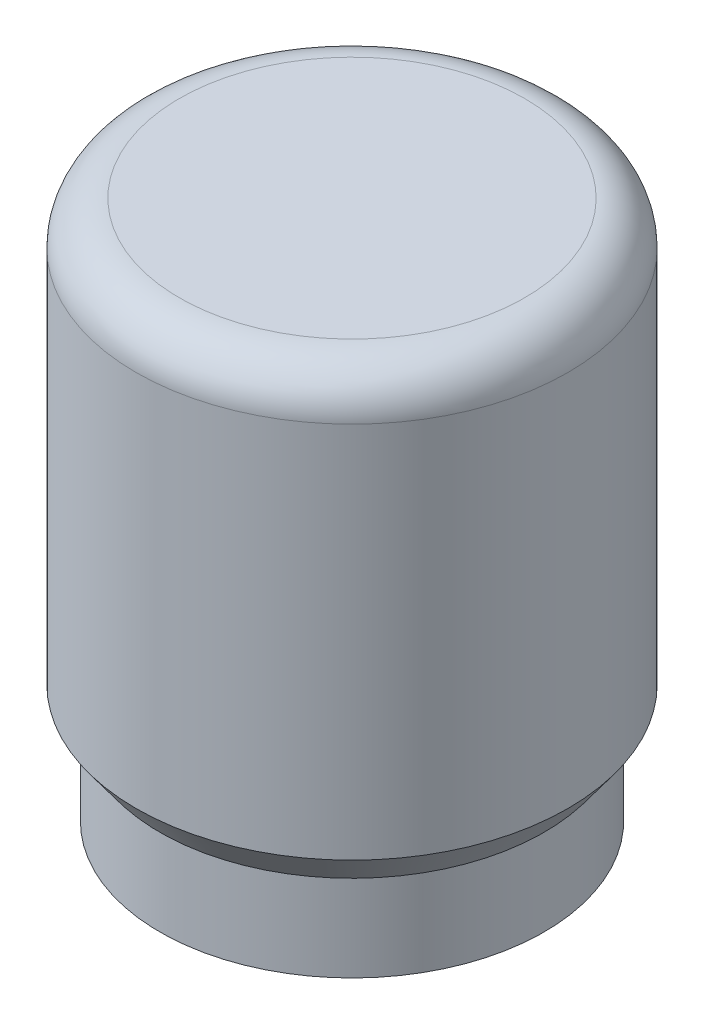
ISO-10303-21;
HEADER;
FILE_DESCRIPTION(('STEP AP214'),'2;1');
FILE_NAME('part.step','',(''),(''),'','','');
FILE_SCHEMA(('AUTOMOTIVE_DESIGN { 1 0 10303 214 1 1 1 1 }'));
ENDSEC;
DATA;
#1=APPLICATION_CONTEXT('core data for automotive mechanical design processes');
#2=APPLICATION_PROTOCOL_DEFINITION('international standard','automotive_design',2000,#1);
#3=PRODUCT_CONTEXT('',#1,'mechanical');
#4=PRODUCT('Part','Part','',(#3));
#5=PRODUCT_RELATED_PRODUCT_CATEGORY('part','',(#4));
#6=PRODUCT_DEFINITION_FORMATION('','',#4);
#7=PRODUCT_DEFINITION_CONTEXT('part definition',#1,'design');
#8=PRODUCT_DEFINITION('design','',#6,#7);
#9=PRODUCT_DEFINITION_SHAPE('','',#8);
#10=(LENGTH_UNIT() NAMED_UNIT(*) SI_UNIT(.MILLI.,.METRE.));
#11=(NAMED_UNIT(*) PLANE_ANGLE_UNIT() SI_UNIT($,.RADIAN.));
#12=(NAMED_UNIT(*) SI_UNIT($,.STERADIAN.) SOLID_ANGLE_UNIT());
#13=UNCERTAINTY_MEASURE_WITH_UNIT(LENGTH_MEASURE(1.E-05),#10,'distance_accuracy_value','');
#14=(GEOMETRIC_REPRESENTATION_CONTEXT(3) GLOBAL_UNCERTAINTY_ASSIGNED_CONTEXT((#13)) GLOBAL_UNIT_ASSIGNED_CONTEXT((#10,
#11,#12)) REPRESENTATION_CONTEXT('',''));
#15=CARTESIAN_POINT('',(0.,0.,0.));
#16=DIRECTION('',(0.,0.,1.));
#17=DIRECTION('',(1.,0.,0.));
#18=AXIS2_PLACEMENT_3D('',#15,#16,#17);
#19=CARTESIAN_POINT('',(0.,14.605,0.));
#20=DIRECTION('',(0.,-1.,0.));
#21=DIRECTION('',(0.,0.,-1.));
#22=AXIS2_PLACEMENT_3D('',#19,#20,#21);
#23=TOROIDAL_SURFACE('',#22,5.08,1.27);
#24=CARTESIAN_POINT('',(0.,15.875,0.));
#25=DIRECTION('',(0.,-1.,0.));
#26=DIRECTION('',(0.,0.,-1.));
#27=AXIS2_PLACEMENT_3D('',#24,#25,#26);
#28=CIRCLE('',#27,5.08);
#29=CARTESIAN_POINT('',(0.,15.875,-5.08));
#30=VERTEX_POINT('',#29);
#31=EDGE_CURVE('E74',#30,#30,#28,.T.);
#32=ORIENTED_EDGE('',*,*,#31,.T.);
#33=EDGE_LOOP('',(#32));
#34=FACE_BOUND('',#33,.T.);
#35=CARTESIAN_POINT('',(0.,14.605,0.));
#36=DIRECTION('',(0.,-1.,0.));
#37=DIRECTION('',(0.,0.,-1.));
#38=AXIS2_PLACEMENT_3D('',#35,#36,#37);
#39=CIRCLE('',#38,6.35);
#40=CARTESIAN_POINT('',(0.,14.605,-6.35));
#41=VERTEX_POINT('',#40);
#42=EDGE_CURVE('E11',#41,#41,#39,.T.);
#43=ORIENTED_EDGE('',*,*,#42,.F.);
#44=EDGE_LOOP('',(#43));
#45=FACE_BOUND('',#44,.T.);
#46=ADVANCED_FACE('F33',(#34,#45),#23,.T.);
#47=CARTESIAN_POINT('',(0.,0.,0.));
#48=DIRECTION('',(0.,-1.,0.));
#49=DIRECTION('',(0.,0.,-1.));
#50=AXIS2_PLACEMENT_3D('',#47,#48,#49);
#51=CYLINDRICAL_SURFACE('',#50,6.35);
#52=CARTESIAN_POINT('',(0.,8.9662,-6.35));
#53=CARTESIAN_POINT('',(0.0951449863036409,8.96619789147214,-6.34999863875941));
#54=CARTESIAN_POINT('',(0.190312288851531,8.95831190836092,-6.34784064346853));
#55=CARTESIAN_POINT('',(0.377900784745492,8.92703504636082,-6.33944172576789));
#56=CARTESIAN_POINT('',(0.470320714382607,8.90363714432022,-6.33319895395791));
#57=CARTESIAN_POINT('',(0.649679940351944,8.84215689864135,-6.31731876401478));
#58=CARTESIAN_POINT('',(0.736626286687476,8.80409391334608,-6.30768582245074));
#59=CARTESIAN_POINT('',(0.902901574741107,8.71443692060387,-6.28604072665375));
#60=CARTESIAN_POINT('',(0.982229927307515,8.66284186777881,-6.27402838862543));
#61=CARTESIAN_POINT('',(1.13292446066586,8.54627611010616,-6.24859613189591));
#62=CARTESIAN_POINT('',(1.20408142778442,8.48104034875201,-6.23515139682222));
#63=CARTESIAN_POINT('',(1.33459195857133,8.33961131077172,-6.20852721689338));
#64=CARTESIAN_POINT('',(1.39394393677014,8.26341656466341,-6.19534780788622));
#65=CARTESIAN_POINT('',(1.50019197608792,8.10054726539216,-6.17049137148356));
#66=CARTESIAN_POINT('',(1.54684512722838,8.01370904212055,-6.1588455857585));
#67=CARTESIAN_POINT('',(1.62480576859993,7.8330531566705,-6.1387407874426));
#68=CARTESIAN_POINT('',(1.65611621594531,7.73923684344963,-6.13028116083224));
#69=CARTESIAN_POINT('',(1.70177180214679,7.54961011264782,-6.11776309569238));
#70=CARTESIAN_POINT('',(1.71649726990973,7.45389792706884,-6.11360617617922));
#71=CARTESIAN_POINT('',(1.72975094731642,7.26127835068999,-6.10987013883377));
#72=CARTESIAN_POINT('',(1.72828231634452,7.16437119670718,-6.11029012807023));
#73=CARTESIAN_POINT('',(1.70949093267711,6.97509947123521,-6.11557244215812));
#74=CARTESIAN_POINT('',(1.6926307931423,6.88268477354555,-6.12030513530989));
#75=CARTESIAN_POINT('',(1.64427691366298,6.70204801188243,-6.13347170999125));
#76=CARTESIAN_POINT('',(1.61278196212681,6.6138262957056,-6.1419058979582));
#77=CARTESIAN_POINT('',(1.53568116284808,6.44288536879236,-6.16163749262478));
#78=CARTESIAN_POINT('',(1.48991501354338,6.36024234000684,-6.1729671478322));
#79=CARTESIAN_POINT('',(1.38568270537137,6.20364765257256,-6.19719605878187));
#80=CARTESIAN_POINT('',(1.32721395584747,6.12969777161298,-6.21009563446823));
#81=CARTESIAN_POINT('',(1.19688110939867,5.9899482409435,-6.23654842675368));
#82=CARTESIAN_POINT('',(1.12462920064179,5.92451112904993,-6.25010895618575));
#83=CARTESIAN_POINT('',(0.970010724753629,5.80660646666903,-6.27596319686257));
#84=CARTESIAN_POINT('',(0.887643726686708,5.75413946903778,-6.28825685409337));
#85=CARTESIAN_POINT('',(0.714556958944036,5.6634957646648,-6.31027294241733));
#86=CARTESIAN_POINT('',(0.623799990969472,5.62538691286079,-6.31998310231079));
#87=CARTESIAN_POINT('',(0.436842597805193,5.56507348110458,-6.33564952931861));
#88=CARTESIAN_POINT('',(0.340643417178253,5.54286528061886,-6.34160665095209));
#89=CARTESIAN_POINT('',(0.148624454884181,5.51555800182054,-6.34896565310046));
#90=CARTESIAN_POINT('',(0.0528796523447617,5.50996627599482,-6.35049865947629));
#91=CARTESIAN_POINT('',(-0.138180466350691,5.51468706727376,-6.34921487161198));
#92=CARTESIAN_POINT('',(-0.233495827720302,5.52499786889324,-6.34639854655591));
#93=CARTESIAN_POINT('',(-0.4192176472349,5.56082770991179,-6.33681743547874));
#94=CARTESIAN_POINT('',(-0.509681554300033,5.58606996741095,-6.33012455441942));
#95=CARTESIAN_POINT('',(-0.685080515875142,5.65072301107799,-6.3135514774359));
#96=CARTESIAN_POINT('',(-0.770014958031545,5.6901353633533,-6.30367092921669));
#97=CARTESIAN_POINT('',(-0.933842871298505,5.78291015753946,-6.28151367373741));
#98=CARTESIAN_POINT('',(-1.01257992293401,5.83653796387576,-6.26919265156916));
#99=CARTESIAN_POINT('',(-1.16010959845038,5.95588954499191,-6.24357763517254));
#100=CARTESIAN_POINT('',(-1.22890017081352,6.02161580881088,-6.23028344107123));
#101=CARTESIAN_POINT('',(-1.35667489085896,6.16560078405838,-6.20373464008594));
#102=CARTESIAN_POINT('',(-1.41531088896525,6.24417137654907,-6.19049271062574));
#103=CARTESIAN_POINT('',(-1.5185758631089,6.41031885211516,-6.16597557643662));
#104=CARTESIAN_POINT('',(-1.5632054027687,6.49789537260204,-6.15470029257764));
#105=CARTESIAN_POINT('',(-1.6368559751369,6.6791484834366,-6.13552375399684));
#106=CARTESIAN_POINT('',(-1.66596580431958,6.77278685645487,-6.12760335896582));
#107=CARTESIAN_POINT('',(-1.70795018568577,6.9638830851753,-6.11603543572629));
#108=CARTESIAN_POINT('',(-1.72082909286853,7.0613399090906,-6.11238676136987));
#109=CARTESIAN_POINT('',(-1.72972820607105,7.25373465762908,-6.10987385307678));
#110=CARTESIAN_POINT('',(-1.72630910449696,7.34864494957619,-6.11085048923279));
#111=CARTESIAN_POINT('',(-1.70401564164396,7.53648094748427,-6.11710404836426));
#112=CARTESIAN_POINT('',(-1.68514170902971,7.62940670841607,-6.12238085206763));
#113=CARTESIAN_POINT('',(-1.63280539478538,7.80989810539161,-6.13654353855073));
#114=CARTESIAN_POINT('',(-1.59946635118619,7.89750207273098,-6.14539886587388));
#115=CARTESIAN_POINT('',(-1.51924173886316,8.06594035637948,-6.16572049242441));
#116=CARTESIAN_POINT('',(-1.47235396775738,8.14677356932667,-6.17718721607701));
#117=CARTESIAN_POINT('',(-1.36468279754848,8.30204093302555,-6.20187674823452));
#118=CARTESIAN_POINT('',(-1.30351895887018,8.37620447054231,-6.21514247340964));
#119=CARTESIAN_POINT('',(-1.16974944785565,8.5133972273559,-6.24170076170646));
#120=CARTESIAN_POINT('',(-1.09714097225845,8.57642371068786,-6.25499333061375));
#121=CARTESIAN_POINT('',(-0.940569840441394,8.69095231575586,-6.28046587068278));
#122=CARTESIAN_POINT('',(-0.856388240274029,8.74216281841212,-6.29261402973329));
#123=CARTESIAN_POINT('',(-0.680282177868769,8.82962505398807,-6.31407641863104));
#124=CARTESIAN_POINT('',(-0.588362527640945,8.8658860019416,-6.32339239332814));
#125=CARTESIAN_POINT('',(-0.414040485051695,8.91791147235791,-6.33699456382282));
#126=CARTESIAN_POINT('',(-0.332360724920962,8.93597659493757,-6.34183536085971));
#127=CARTESIAN_POINT('',(-0.167126247178072,8.96012113992317,-6.34833850577101));
#128=CARTESIAN_POINT('',(-0.0835717322995386,8.96620185205056,-6.3500011956619));
#129=CARTESIAN_POINT('',(0.,8.9662,-6.35));
#130=B_SPLINE_CURVE_WITH_KNOTS('',3,(#52,#53,#54,#55,#56,#57,#58,#59,#60,#61,#62,#63,#64,#65,
#66,#67,#68,#69,#70,#71,#72,#73,#74,#75,#76,#77,#78,#79,#80,#81,#82,#83,#84,#85,#86,#87,#88,#89,
#90,#91,#92,#93,#94,#95,#96,#97,#98,#99,#100,#101,#102,#103,#104,#105,#106,#107,#108,#109,#110,
#111,#112,#113,#114,#115,#116,#117,#118,#119,#120,#121,#122,#123,#124,#125,#126,#127,#128,#129),
.UNSPECIFIED.,.T.,.F.,(4,2,2,2,2,2,2,2,2,2,2,2,2,2,2,2,2,2,2,2,2,2,2,2,2,2,2,2,2,2,2,2,2,2,2,2,
2,2,4),(0.,0.285128405017792,0.57038599256176,0.855268314675117,1.14017265097861,
1.43123640676031,1.72233922751515,2.01867139312996,2.31494642193913,2.60427934323216,
2.89355581817747,3.17441408333316,3.45529560441984,3.73945326293843,4.02366892903956,
4.31754671771736,4.61143703088901,4.90669931535446,5.20189434803006,5.48824548103982,
5.7745657260811,6.05573785032932,6.33694105984503,6.62381671145078,6.91075144863872,
7.20612995590427,7.50149657556014,7.7951546002332,8.08873381527749,8.37228753102227,
8.65583338221403,8.93700765801566,9.21822766518484,9.50803100601369,9.79790544219255,
10.094310404606,10.3905323862964,10.6410052744421,10.8914512060763),.UNSPECIFIED.);
#131=CARTESIAN_POINT('',(0.,8.9662,-6.35));
#132=VERTEX_POINT('',#131);
#133=EDGE_CURVE('E101',#132,#132,#130,.T.);
#134=ORIENTED_EDGE('',*,*,#133,.F.);
#135=EDGE_LOOP('',(#134));
#136=FACE_BOUND('',#135,.T.);
#137=ORIENTED_EDGE('',*,*,#42,.T.);
#138=EDGE_LOOP('',(#137));
#139=FACE_BOUND('',#138,.T.);
#140=CARTESIAN_POINT('',(0.,3.49584210526316,0.));
#141=DIRECTION('',(0.,-1.,0.));
#142=DIRECTION('',(0.,0.,-1.));
#143=AXIS2_PLACEMENT_3D('',#140,#141,#142);
#144=CIRCLE('',#143,6.35);
#145=CARTESIAN_POINT('',(0.,3.49584210526316,-6.35));
#146=VERTEX_POINT('',#145);
#147=EDGE_CURVE('E44',#146,#146,#144,.T.);
#148=ORIENTED_EDGE('',*,*,#147,.F.);
#149=EDGE_LOOP('',(#148));
#150=FACE_BOUND('',#149,.T.);
#151=ADVANCED_FACE('F64',(#136,#139,#150),#51,.T.);
#152=CARTESIAN_POINT('',(0.,2.54,0.));
#153=DIRECTION('',(0.,1.,0.));
#154=DIRECTION('',(0.,0.,1.));
#155=AXIS2_PLACEMENT_3D('',#152,#153,#154);
#156=CONICAL_SURFACE('',#155,5.6515,0.63107938747133);
#157=ORIENTED_EDGE('',*,*,#147,.T.);
#158=EDGE_LOOP('',(#157));
#159=FACE_BOUND('',#158,.T.);
#160=CARTESIAN_POINT('',(0.,2.54,0.));
#161=DIRECTION('',(0.,-1.,0.));
#162=DIRECTION('',(0.,0.,-1.));
#163=AXIS2_PLACEMENT_3D('',#160,#161,#162);
#164=CIRCLE('',#163,5.6515);
#165=CARTESIAN_POINT('',(0.,2.54,-5.6515));
#166=VERTEX_POINT('',#165);
#167=EDGE_CURVE('E81',#166,#166,#164,.T.);
#168=ORIENTED_EDGE('',*,*,#167,.F.);
#169=EDGE_LOOP('',(#168));
#170=FACE_BOUND('',#169,.T.);
#171=ADVANCED_FACE('F69',(#159,#170),#156,.T.);
#172=CARTESIAN_POINT('',(0.,0.,0.));
#173=DIRECTION('',(0.,-1.,0.));
#174=DIRECTION('',(0.,0.,-1.));
#175=AXIS2_PLACEMENT_3D('',#172,#173,#174);
#176=CYLINDRICAL_SURFACE('',#175,5.6515);
#177=ORIENTED_EDGE('',*,*,#167,.T.);
#178=EDGE_LOOP('',(#177));
#179=FACE_BOUND('',#178,.T.);
#180=CARTESIAN_POINT('',(0.,0.,0.));
#181=DIRECTION('',(0.,-1.,0.));
#182=DIRECTION('',(0.,0.,-1.));
#183=AXIS2_PLACEMENT_3D('',#180,#181,#182);
#184=CIRCLE('',#183,5.6515);
#185=CARTESIAN_POINT('',(0.,0.,-5.6515));
#186=VERTEX_POINT('',#185);
#187=EDGE_CURVE('E84',#186,#186,#184,.T.);
#188=ORIENTED_EDGE('',*,*,#187,.F.);
#189=EDGE_LOOP('',(#188));
#190=FACE_BOUND('',#189,.T.);
#191=ADVANCED_FACE('F136',(#179,#190),#176,.T.);
#192=CARTESIAN_POINT('',(5.6515,0.,0.));
#193=DIRECTION('',(0.,-1.,0.));
#194=DIRECTION('',(0.,0.,-1.));
#195=AXIS2_PLACEMENT_3D('',#192,#193,#194);
#196=PLANE('',#195);
#197=ORIENTED_EDGE('',*,*,#187,.T.);
#198=EDGE_LOOP('',(#197));
#199=FACE_BOUND('',#198,.T.);
#200=CARTESIAN_POINT('',(0.,0.,0.));
#201=DIRECTION('',(0.,-1.,0.));
#202=DIRECTION('',(0.,0.,-1.));
#203=AXIS2_PLACEMENT_3D('',#200,#201,#202);
#204=CIRCLE('',#203,4.7625);
#205=CARTESIAN_POINT('',(0.,0.,-4.7625));
#206=VERTEX_POINT('',#205);
#207=EDGE_CURVE('E89',#206,#206,#204,.T.);
#208=ORIENTED_EDGE('',*,*,#207,.F.);
#209=EDGE_LOOP('',(#208));
#210=FACE_BOUND('',#209,.T.);
#211=ADVANCED_FACE('F129',(#199,#210),#196,.T.);
#212=CARTESIAN_POINT('',(0.,0.,0.));
#213=DIRECTION('',(0.,-1.,0.));
#214=DIRECTION('',(0.,0.,-1.));
#215=AXIS2_PLACEMENT_3D('',#212,#213,#214);
#216=CYLINDRICAL_SURFACE('',#215,4.7625);
#217=ORIENTED_EDGE('',*,*,#207,.T.);
#218=EDGE_LOOP('',(#217));
#219=FACE_BOUND('',#218,.T.);
#220=CARTESIAN_POINT('',(0.,3.9878,0.));
#221=DIRECTION('',(0.,-1.,0.));
#222=DIRECTION('',(0.,0.,-1.));
#223=AXIS2_PLACEMENT_3D('',#220,#221,#222);
#224=CIRCLE('',#223,4.7625);
#225=CARTESIAN_POINT('',(0.,3.9878,-4.7625));
#226=VERTEX_POINT('',#225);
#227=EDGE_CURVE('E92',#226,#226,#224,.T.);
#228=ORIENTED_EDGE('',*,*,#227,.F.);
#229=EDGE_LOOP('',(#228));
#230=FACE_BOUND('',#229,.T.);
#231=ADVANCED_FACE('F123',(#219,#230),#216,.F.);
#232=CARTESIAN_POINT('',(4.7625,3.9878,0.));
#233=DIRECTION('',(0.,-1.,0.));
#234=DIRECTION('',(0.,0.,-1.));
#235=AXIS2_PLACEMENT_3D('',#232,#233,#234);
#236=PLANE('',#235);
#237=ORIENTED_EDGE('',*,*,#227,.T.);
#238=EDGE_LOOP('',(#237));
#239=FACE_BOUND('',#238,.T.);
#240=CARTESIAN_POINT('',(0.,3.9878,0.));
#241=DIRECTION('',(0.,-1.,0.));
#242=DIRECTION('',(0.,0.,-1.));
#243=AXIS2_PLACEMENT_3D('',#240,#241,#242);
#244=CIRCLE('',#243,3.);
#245=CARTESIAN_POINT('',(0.,3.9878,-3.));
#246=VERTEX_POINT('',#245);
#247=EDGE_CURVE('E95',#246,#246,#244,.T.);
#248=ORIENTED_EDGE('',*,*,#247,.F.);
#249=EDGE_LOOP('',(#248));
#250=FACE_BOUND('',#249,.T.);
#251=ADVANCED_FACE('F60',(#239,#250),#236,.T.);
#252=CARTESIAN_POINT('',(0.,0.,0.));
#253=DIRECTION('',(0.,-1.,0.));
#254=DIRECTION('',(0.,0.,-1.));
#255=AXIS2_PLACEMENT_3D('',#252,#253,#254);
#256=CYLINDRICAL_SURFACE('',#255,3.);
#257=CARTESIAN_POINT('',(0.,8.9662,-3.));
#258=CARTESIAN_POINT('',(-0.088957178395058,8.96619525177285,-2.99999572186425));
#259=CARTESIAN_POINT('',(-0.178059757961187,8.9592803553216,-2.99599981494156));
#260=CARTESIAN_POINT('',(-0.353604065731126,8.9319604936281,-2.98039824386921));
#261=CARTESIAN_POINT('',(-0.440038633113218,8.91152205529975,-2.96877369811598));
#262=CARTESIAN_POINT('',(-0.607345936496613,8.85826546856337,-2.93910119187331));
#263=CARTESIAN_POINT('',(-0.688242999982242,8.82550621107138,-2.92108381061783));
#264=CARTESIAN_POINT('',(-0.843171090611766,8.74888689038463,-2.88018940121096));
#265=CARTESIAN_POINT('',(-0.91720384577218,8.70502963141754,-2.85731360091248));
#266=CARTESIAN_POINT('',(-1.06240583874449,8.60388255981404,-2.806710988612));
#267=CARTESIAN_POINT('',(-1.13297302814551,8.54584666287256,-2.77875212504775));
#268=CARTESIAN_POINT('',(-1.26395818909509,8.41964205559735,-2.72167701928767));
#269=CARTESIAN_POINT('',(-1.32436395829543,8.35146134532895,-2.69255943677675));
#270=CARTESIAN_POINT('',(-1.44007493920136,8.19797757353581,-2.63265634167467));
#271=CARTESIAN_POINT('',(-1.49407478701677,8.11161453381473,-2.60204313717596));
#272=CARTESIAN_POINT('',(-1.58656363887581,7.92925025783439,-2.54671077371979));
#273=CARTESIAN_POINT('',(-1.62507638569877,7.83326405898344,-2.52198261652682));
#274=CARTESIAN_POINT('',(-1.67794366597839,7.65640793679905,-2.48702133910358));
#275=CARTESIAN_POINT('',(-1.69577919427152,7.57697615068264,-2.47478111587059));
#276=CARTESIAN_POINT('',(-1.720075135497,7.41562912739067,-2.45796043182049));
#277=CARTESIAN_POINT('',(-1.72654802110821,7.33371671381698,-2.45337157244254));
#278=CARTESIAN_POINT('',(-1.72775888653904,7.1696439857797,-2.45251915085678));
#279=CARTESIAN_POINT('',(-1.7224798954531,7.08748348413406,-2.45626762860509));
#280=CARTESIAN_POINT('',(-1.70046948261898,6.92543918071039,-2.47155314164618));
#281=CARTESIAN_POINT('',(-1.68373006753162,6.84555700853961,-2.48309561296385));
#282=CARTESIAN_POINT('',(-1.63974849495735,6.69043996797567,-2.51235135009782));
#283=CARTESIAN_POINT('',(-1.61256016779111,6.61518353679331,-2.53003294424632));
#284=CARTESIAN_POINT('',(-1.54863283681664,6.47007163604411,-2.56965908483862));
#285=CARTESIAN_POINT('',(-1.51189020049287,6.40021823382452,-2.59160525185466));
#286=CARTESIAN_POINT('',(-1.42300005389724,6.25584300156301,-2.64160371816294));
#287=CARTESIAN_POINT('',(-1.36931954291139,6.18240682656482,-2.67006876458206));
#288=CARTESIAN_POINT('',(-1.25120354730753,6.04487370902029,-2.72741757184295));
#289=CARTESIAN_POINT('',(-1.18675871654988,5.9807849737794,-2.75630167645772));
#290=CARTESIAN_POINT('',(-1.03988156000557,5.85618020419751,-2.81524641087587));
#291=CARTESIAN_POINT('',(-0.956225503496786,5.79696840409932,-2.84504661661512));
#292=CARTESIAN_POINT('',(-0.778316022760589,5.69368409715477,-2.89876446308849));
#293=CARTESIAN_POINT('',(-0.684069214742307,5.64960220744279,-2.92268574703251));
#294=CARTESIAN_POINT('',(-0.494263674693495,5.58117393764256,-2.96047489562646));
#295=CARTESIAN_POINT('',(-0.399236376421066,5.55568315673514,-2.97491885903034));
#296=CARTESIAN_POINT('',(-0.205330475834635,5.52123196759914,-2.99454501892198));
#297=CARTESIAN_POINT('',(-0.106455890846233,5.5122547651237,-2.99973662485463));
#298=CARTESIAN_POINT('',(0.0791195795043313,5.51143245690457,-3.00021296702448));
#299=CARTESIAN_POINT('',(0.165816538188768,5.51760928977649,-2.99664153802955));
#300=CARTESIAN_POINT('',(0.336711468814566,5.54273874398873,-2.98227689280544));
#301=CARTESIAN_POINT('',(0.420909409740651,5.561691523822,-2.97148358698474));
#302=CARTESIAN_POINT('',(0.583580840000068,5.61117919141931,-2.9438355165247));
#303=CARTESIAN_POINT('',(0.662111589963159,5.64157010633352,-2.9270562294967));
#304=CARTESIAN_POINT('',(0.813002085415193,5.71282316300994,-2.8887876171751));
#305=CARTESIAN_POINT('',(0.885360383407257,5.75368775199687,-2.86729719127106));
#306=CARTESIAN_POINT('',(1.02997875767283,5.84952015256256,-2.81878518680845));
#307=CARTESIAN_POINT('',(1.10144266445733,5.90551393529825,-2.79142057704255));
#308=CARTESIAN_POINT('',(1.23451495882029,6.02765181330409,-2.73517892125234));
#309=CARTESIAN_POINT('',(1.29611181947061,6.0938076059557,-2.70630015786033));
#310=CARTESIAN_POINT('',(1.41489444076671,6.24329729872007,-2.64631561491998));
#311=CARTESIAN_POINT('',(1.47076877553742,6.32773064191085,-2.61533316674441));
#312=CARTESIAN_POINT('',(1.56742269333947,6.50641047272818,-2.55858146031653));
#313=CARTESIAN_POINT('',(1.60822186416989,6.60064402094431,-2.53280545700427));
#314=CARTESIAN_POINT('',(1.66588886334967,6.77573567830077,-2.49514287255722));
#315=CARTESIAN_POINT('',(1.68601113464146,6.85513403553,-2.48146369798536));
#316=CARTESIAN_POINT('',(1.71481814265424,7.01686297349648,-2.46164870238754));
#317=CARTESIAN_POINT('',(1.72351633033901,7.09918998839619,-2.45550401066541));
#318=CARTESIAN_POINT('',(1.72899615097863,7.26463051494138,-2.45164970391752));
#319=CARTESIAN_POINT('',(1.72575102848437,7.34774537590942,-2.45395902754771));
#320=CARTESIAN_POINT('',(1.70748527065169,7.51205022945451,-2.46670032916554));
#321=CARTESIAN_POINT('',(1.69245725492443,7.5932389827369,-2.47713739805838));
#322=CARTESIAN_POINT('',(1.65186956199779,7.74983917314406,-2.50437631683445));
#323=CARTESIAN_POINT('',(1.62654360271558,7.82533736262805,-2.52103629183799));
#324=CARTESIAN_POINT('',(1.5663232651711,7.97117715354389,-2.55888508226331));
#325=CARTESIAN_POINT('',(1.53142540754798,8.0415168680771,-2.5800755438867));
#326=CARTESIAN_POINT('',(1.44683240588001,8.18662742625477,-2.62857376888971));
#327=CARTESIAN_POINT('',(1.395684207535,8.26040430901485,-2.65632084511263));
#328=CARTESIAN_POINT('',(1.28277825168906,8.39904434447575,-2.71264915569304));
#329=CARTESIAN_POINT('',(1.22101104293199,8.46389946315348,-2.74123111414772));
#330=CARTESIAN_POINT('',(1.07907460038926,8.59142872800046,-2.80040159876259));
#331=CARTESIAN_POINT('',(0.997556458710613,8.65271911925823,-2.83076675327214));
#332=CARTESIAN_POINT('',(0.823643286823735,8.76060213703301,-2.88615825234293));
#333=CARTESIAN_POINT('',(0.731254424536104,8.80720304349524,-2.9111876019246));
#334=CARTESIAN_POINT('',(0.555280994876818,8.87673580316312,-2.94928415491367));
#335=CARTESIAN_POINT('',(0.473061959487046,8.90240584210788,-2.96368827878003));
#336=CARTESIAN_POINT('',(0.304968866333643,8.94123638442083,-2.98565355667014));
#337=CARTESIAN_POINT('',(0.219105870370107,8.95443226298199,-2.99323405871273));
#338=CARTESIAN_POINT('',(0.110639187532516,8.96279587147931,-2.99804144590568));
#339=CARTESIAN_POINT('',(0.0885406697673401,8.9640711030598,-2.99877473789585));
#340=CARTESIAN_POINT('',(0.0442977773597713,8.96577381046081,-2.99975457744592));
#341=CARTESIAN_POINT('',(0.0221533974343778,8.96620118247189,-3.00000106540297));
#342=CARTESIAN_POINT('',(0.,8.9662,-3.));
#343=B_SPLINE_CURVE_WITH_KNOTS('',3,(#257,#258,#259,#260,#261,#262,#263,#264,#265,#266,#267,
#268,#269,#270,#271,#272,#273,#274,#275,#276,#277,#278,#279,#280,#281,#282,#283,#284,#285,#286,
#287,#288,#289,#290,#291,#292,#293,#294,#295,#296,#297,#298,#299,#300,#301,#302,#303,#304,#305,
#306,#307,#308,#309,#310,#311,#312,#313,#314,#315,#316,#317,#318,#319,#320,#321,#322,#323,#324,
#325,#326,#327,#328,#329,#330,#331,#332,#333,#334,#335,#336,#337,#338,#339,#340,#341,#342),
.UNSPECIFIED.,.T.,.F.,(4,2,2,2,2,2,2,2,2,2,2,2,2,2,2,2,2,2,2,2,2,2,2,2,2,2,2,2,2,2,2,2,2,2,2,2,
2,2,2,2,2,2,4),(0.,0.26677813994696,0.534219084116476,0.800397635795866,1.06650899688925,
1.35201710108215,1.63786564755063,1.95536521341845,2.27237615799585,2.51828602780104,
2.76392579518604,3.00992052146354,3.25608699750878,3.50100192366422,3.74601010212638,
4.03082814444813,4.31589477839881,4.63445087880184,4.9528090670813,5.24937455495953,
5.54563826975523,5.80532990271289,6.06502475735348,6.32155456466734,6.57814436614483,
6.86147580211717,7.14513585630113,7.46125667158619,7.77696528113654,8.02503529369942,
8.27281296062349,8.52114603754375,8.76963478592958,9.01277345717991,9.25600062611897,
9.53679997896462,9.81785055837522,10.1354993130807,10.4529686988713,10.7138567914664,
10.9740027980122,11.0404315988436,11.1068685325197),.UNSPECIFIED.);
#344=CARTESIAN_POINT('',(0.,8.9662,-3.));
#345=VERTEX_POINT('',#344);
#346=EDGE_CURVE('E36',#345,#345,#343,.T.);
#347=ORIENTED_EDGE('',*,*,#346,.F.);
#348=EDGE_LOOP('',(#347));
#349=FACE_BOUND('',#348,.T.);
#350=ORIENTED_EDGE('',*,*,#247,.T.);
#351=EDGE_LOOP('',(#350));
#352=FACE_BOUND('',#351,.T.);
#353=CARTESIAN_POINT('',(0.,12.954,0.));
#354=DIRECTION('',(0.,-1.,0.));
#355=DIRECTION('',(0.,0.,-1.));
#356=AXIS2_PLACEMENT_3D('',#353,#354,#355);
#357=CIRCLE('',#356,3.);
#358=CARTESIAN_POINT('',(0.,12.954,-3.));
#359=VERTEX_POINT('',#358);
#360=EDGE_CURVE('E98',#359,#359,#357,.T.);
#361=ORIENTED_EDGE('',*,*,#360,.F.);
#362=EDGE_LOOP('',(#361));
#363=FACE_BOUND('',#362,.T.);
#364=ADVANCED_FACE('F50',(#349,#352,#363),#256,.F.);
#365=CARTESIAN_POINT('',(0.,14.6860508075689,0.));
#366=DIRECTION('',(0.,-1.,0.));
#367=DIRECTION('',(0.,0.,-1.));
#368=AXIS2_PLACEMENT_3D('',#365,#366,#367);
#369=CONICAL_SURFACE('',#368,0.,1.0471975511966);
#370=ORIENTED_EDGE('',*,*,#360,.T.);
#371=EDGE_LOOP('',(#370));
#372=FACE_BOUND('',#371,.T.);
#373=CARTESIAN_POINT('',(0.,14.6860508075689,0.));
#374=VERTEX_POINT('',#373);
#375=VERTEX_LOOP('',#374);
#376=FACE_BOUND('',#375,.T.);
#377=ADVANCED_FACE('F47',(#372,#376),#369,.F.);
#378=CARTESIAN_POINT('',(0.,15.875,0.));
#379=DIRECTION('',(0.,1.,0.));
#380=DIRECTION('',(0.,0.,1.));
#381=AXIS2_PLACEMENT_3D('',#378,#379,#380);
#382=PLANE('',#381);
#383=ORIENTED_EDGE('',*,*,#31,.F.);
#384=EDGE_LOOP('',(#383));
#385=FACE_BOUND('',#384,.T.);
#386=ADVANCED_FACE('F49',(#385),#382,.T.);
#387=CARTESIAN_POINT('',(0.,7.239,-6.35));
#388=DIRECTION('',(0.,0.,1.));
#389=DIRECTION('',(1.,0.,0.));
#390=AXIS2_PLACEMENT_3D('',#387,#388,#389);
#391=CYLINDRICAL_SURFACE('',#390,1.7272);
#392=ORIENTED_EDGE('',*,*,#133,.T.);
#393=EDGE_LOOP('',(#392));
#394=FACE_BOUND('',#393,.T.);
#395=ORIENTED_EDGE('',*,*,#346,.T.);
#396=EDGE_LOOP('',(#395));
#397=FACE_BOUND('',#396,.T.);
#398=ADVANCED_FACE('F57',(#394,#397),#391,.F.);
#399=CLOSED_SHELL('',(#46,#151,#171,#191,#211,#231,#251,#364,#377,#386,#398));
#400=MANIFOLD_SOLID_BREP('B2',#399);
#401=ADVANCED_BREP_SHAPE_REPRESENTATION('',(#18,#400),#14);
#402=SHAPE_DEFINITION_REPRESENTATION(#9,#401);
ENDSEC;
END-ISO-10303-21;
